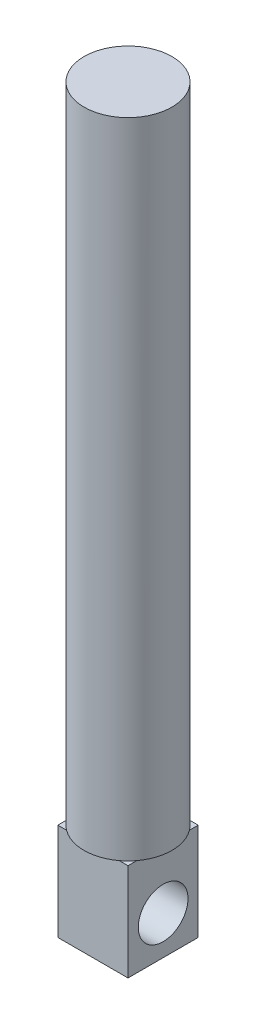
ISO-10303-21;
HEADER;
FILE_DESCRIPTION(('STEP AP214'),'2;1');
FILE_NAME('part.step','',(''),(''),'','','');
FILE_SCHEMA(('AUTOMOTIVE_DESIGN { 1 0 10303 214 1 1 1 1 }'));
ENDSEC;
DATA;
#1=APPLICATION_CONTEXT('core data for automotive mechanical design processes');
#2=APPLICATION_PROTOCOL_DEFINITION('international standard','automotive_design',2000,#1);
#3=PRODUCT_CONTEXT('',#1,'mechanical');
#4=PRODUCT('Part','Part','',(#3));
#5=PRODUCT_RELATED_PRODUCT_CATEGORY('part','',(#4));
#6=PRODUCT_DEFINITION_FORMATION('','',#4);
#7=PRODUCT_DEFINITION_CONTEXT('part definition',#1,'design');
#8=PRODUCT_DEFINITION('design','',#6,#7);
#9=PRODUCT_DEFINITION_SHAPE('','',#8);
#10=(LENGTH_UNIT() NAMED_UNIT(*) SI_UNIT(.MILLI.,.METRE.));
#11=(NAMED_UNIT(*) PLANE_ANGLE_UNIT() SI_UNIT($,.RADIAN.));
#12=(NAMED_UNIT(*) SI_UNIT($,.STERADIAN.) SOLID_ANGLE_UNIT());
#13=UNCERTAINTY_MEASURE_WITH_UNIT(LENGTH_MEASURE(1.E-05),#10,'distance_accuracy_value','');
#14=(GEOMETRIC_REPRESENTATION_CONTEXT(3) GLOBAL_UNCERTAINTY_ASSIGNED_CONTEXT((#13)) GLOBAL_UNIT_ASSIGNED_CONTEXT((#10,
#11,#12)) REPRESENTATION_CONTEXT('',''));
#15=CARTESIAN_POINT('',(0.,0.,0.));
#16=DIRECTION('',(0.,0.,1.));
#17=DIRECTION('',(1.,0.,0.));
#18=AXIS2_PLACEMENT_3D('',#15,#16,#17);
#19=CARTESIAN_POINT('',(0.,8.31,0.));
#20=DIRECTION('',(0.,-1.,0.));
#21=DIRECTION('',(0.,0.,-1.));
#22=AXIS2_PLACEMENT_3D('',#19,#20,#21);
#23=PLANE('',#22);
#24=CARTESIAN_POINT('',(3.,8.31,-3.));
#25=DIRECTION('',(0.,1.,0.));
#26=DIRECTION('',(0.,0.,1.));
#27=AXIS2_PLACEMENT_3D('',#24,#25,#26);
#28=CIRCLE('',#27,3.75);
#29=CARTESIAN_POINT('',(5.25,8.31,0.));
#30=VERTEX_POINT('',#29);
#31=CARTESIAN_POINT('',(6.,8.31,-0.749999999999999));
#32=VERTEX_POINT('',#31);
#33=EDGE_CURVE('E127',#30,#32,#28,.T.);
#34=ORIENTED_EDGE('',*,*,#33,.F.);
#35=DIRECTION('',(1.,0.,0.));
#36=VECTOR('',#35,1.);
#37=CARTESIAN_POINT('',(0.,8.31,0.));
#38=LINE('',#37,#36);
#39=CARTESIAN_POINT('',(6.,8.31,0.));
#40=VERTEX_POINT('',#39);
#41=EDGE_CURVE('E114',#30,#40,#38,.T.);
#42=ORIENTED_EDGE('',*,*,#41,.T.);
#43=DIRECTION('',(0.,0.,-1.));
#44=VECTOR('',#43,1.);
#45=CARTESIAN_POINT('',(6.,8.31,0.));
#46=LINE('',#45,#44);
#47=EDGE_CURVE('E148',#40,#32,#46,.T.);
#48=ORIENTED_EDGE('',*,*,#47,.T.);
#49=EDGE_LOOP('',(#34,#42,#48));
#50=FACE_BOUND('',#49,.T.);
#51=ADVANCED_FACE('F33',(#50),#23,.F.);
#52=CARTESIAN_POINT('',(6.,8.31,-5.25));
#53=VERTEX_POINT('',#52);
#54=CARTESIAN_POINT('',(5.25,8.31,-6.));
#55=VERTEX_POINT('',#54);
#56=EDGE_CURVE('E11',#53,#55,#28,.T.);
#57=ORIENTED_EDGE('',*,*,#56,.F.);
#58=CARTESIAN_POINT('',(6.,8.31,-6.));
#59=VERTEX_POINT('',#58);
#60=EDGE_CURVE('E111',#53,#59,#46,.T.);
#61=ORIENTED_EDGE('',*,*,#60,.T.);
#62=DIRECTION('',(-1.,0.,0.));
#63=VECTOR('',#62,1.);
#64=CARTESIAN_POINT('',(0.,8.31,-6.));
#65=LINE('',#64,#63);
#66=EDGE_CURVE('E144',#59,#55,#65,.T.);
#67=ORIENTED_EDGE('',*,*,#66,.T.);
#68=EDGE_LOOP('',(#57,#61,#67));
#69=FACE_BOUND('',#68,.T.);
#70=ADVANCED_FACE('F200',(#69),#23,.F.);
#71=CARTESIAN_POINT('',(0.749999999999999,8.31,-6.));
#72=VERTEX_POINT('',#71);
#73=CARTESIAN_POINT('',(0.,8.31,-5.25));
#74=VERTEX_POINT('',#73);
#75=EDGE_CURVE('E42',#72,#74,#28,.T.);
#76=ORIENTED_EDGE('',*,*,#75,.F.);
#77=CARTESIAN_POINT('',(0.,8.31,-6.));
#78=VERTEX_POINT('',#77);
#79=EDGE_CURVE('E145',#72,#78,#65,.T.);
#80=ORIENTED_EDGE('',*,*,#79,.T.);
#81=DIRECTION('',(0.,0.,1.));
#82=VECTOR('',#81,1.);
#83=CARTESIAN_POINT('',(0.,8.31,0.));
#84=LINE('',#83,#82);
#85=EDGE_CURVE('E180',#78,#74,#84,.T.);
#86=ORIENTED_EDGE('',*,*,#85,.T.);
#87=EDGE_LOOP('',(#76,#80,#86));
#88=FACE_BOUND('',#87,.T.);
#89=ADVANCED_FACE('F206',(#88),#23,.F.);
#90=CARTESIAN_POINT('',(0.,8.31,0.));
#91=DIRECTION('',(1.,0.,0.));
#92=DIRECTION('',(0.,0.,-1.));
#93=AXIS2_PLACEMENT_3D('',#90,#91,#92);
#94=PLANE('',#93);
#95=CARTESIAN_POINT('',(0.,3.31,-3.));
#96=DIRECTION('',(1.,0.,0.));
#97=DIRECTION('',(0.,0.,-1.));
#98=AXIS2_PLACEMENT_3D('',#95,#96,#97);
#99=CIRCLE('',#98,2.125);
#100=CARTESIAN_POINT('',(0.,3.31,-5.125));
#101=VERTEX_POINT('',#100);
#102=EDGE_CURVE('E155',#101,#101,#99,.T.);
#103=ORIENTED_EDGE('',*,*,#102,.T.);
#104=EDGE_LOOP('',(#103));
#105=FACE_BOUND('',#104,.T.);
#106=DIRECTION('',(0.,0.,1.));
#107=VECTOR('',#106,1.);
#108=CARTESIAN_POINT('',(0.,0.,0.));
#109=LINE('',#108,#107);
#110=CARTESIAN_POINT('',(0.,0.,-6.));
#111=VERTEX_POINT('',#110);
#112=CARTESIAN_POINT('',(0.,0.,0.));
#113=VERTEX_POINT('',#112);
#114=EDGE_CURVE('E151',#111,#113,#109,.T.);
#115=ORIENTED_EDGE('',*,*,#114,.T.);
#116=DIRECTION('',(0.,-1.,0.));
#117=VECTOR('',#116,1.);
#118=CARTESIAN_POINT('',(0.,8.31,0.));
#119=LINE('',#118,#117);
#120=CARTESIAN_POINT('',(0.,8.31,0.));
#121=VERTEX_POINT('',#120);
#122=EDGE_CURVE('E37',#121,#113,#119,.T.);
#123=ORIENTED_EDGE('',*,*,#122,.F.);
#124=CARTESIAN_POINT('',(0.,8.31,-0.749999999999999));
#125=VERTEX_POINT('',#124);
#126=EDGE_CURVE('E107',#125,#121,#84,.T.);
#127=ORIENTED_EDGE('',*,*,#126,.F.);
#128=EDGE_CURVE('E182',#74,#125,#84,.T.);
#129=ORIENTED_EDGE('',*,*,#128,.F.);
#130=ORIENTED_EDGE('',*,*,#85,.F.);
#131=DIRECTION('',(0.,-1.,0.));
#132=VECTOR('',#131,1.);
#133=CARTESIAN_POINT('',(0.,8.31,-6.));
#134=LINE('',#133,#132);
#135=EDGE_CURVE('E147',#78,#111,#134,.T.);
#136=ORIENTED_EDGE('',*,*,#135,.T.);
#137=EDGE_LOOP('',(#115,#123,#127,#129,#130,#136));
#138=FACE_BOUND('',#137,.T.);
#139=ADVANCED_FACE('F35',(#105,#138),#94,.F.);
#140=CARTESIAN_POINT('',(0.,8.31,0.));
#141=DIRECTION('',(0.,0.,-1.));
#142=DIRECTION('',(-1.,0.,0.));
#143=AXIS2_PLACEMENT_3D('',#140,#141,#142);
#144=PLANE('',#143);
#145=DIRECTION('',(1.,0.,0.));
#146=VECTOR('',#145,1.);
#147=CARTESIAN_POINT('',(0.,0.,0.));
#148=LINE('',#147,#146);
#149=CARTESIAN_POINT('',(6.,0.,0.));
#150=VERTEX_POINT('',#149);
#151=EDGE_CURVE('E154',#113,#150,#148,.T.);
#152=ORIENTED_EDGE('',*,*,#151,.T.);
#153=DIRECTION('',(0.,-1.,0.));
#154=VECTOR('',#153,1.);
#155=CARTESIAN_POINT('',(6.,8.31,0.));
#156=LINE('',#155,#154);
#157=EDGE_CURVE('E131',#40,#150,#156,.T.);
#158=ORIENTED_EDGE('',*,*,#157,.F.);
#159=ORIENTED_EDGE('',*,*,#41,.F.);
#160=CARTESIAN_POINT('',(0.749999999999999,8.31,0.));
#161=VERTEX_POINT('',#160);
#162=EDGE_CURVE('E112',#161,#30,#38,.T.);
#163=ORIENTED_EDGE('',*,*,#162,.F.);
#164=EDGE_CURVE('E101',#121,#161,#38,.T.);
#165=ORIENTED_EDGE('',*,*,#164,.F.);
#166=ORIENTED_EDGE('',*,*,#122,.T.);
#167=EDGE_LOOP('',(#152,#158,#159,#163,#165,#166));
#168=FACE_BOUND('',#167,.T.);
#169=ADVANCED_FACE('F118',(#168),#144,.F.);
#170=CARTESIAN_POINT('',(6.,8.31,0.));
#171=DIRECTION('',(-1.,0.,0.));
#172=DIRECTION('',(0.,0.,1.));
#173=AXIS2_PLACEMENT_3D('',#170,#171,#172);
#174=PLANE('',#173);
#175=CARTESIAN_POINT('',(6.,3.31,-3.));
#176=DIRECTION('',(1.,0.,0.));
#177=DIRECTION('',(0.,0.,-1.));
#178=AXIS2_PLACEMENT_3D('',#175,#176,#177);
#179=CIRCLE('',#178,2.125);
#180=CARTESIAN_POINT('',(6.,3.31,-5.125));
#181=VERTEX_POINT('',#180);
#182=EDGE_CURVE('E137',#181,#181,#179,.T.);
#183=ORIENTED_EDGE('',*,*,#182,.F.);
#184=EDGE_LOOP('',(#183));
#185=FACE_BOUND('',#184,.T.);
#186=DIRECTION('',(0.,0.,-1.));
#187=VECTOR('',#186,1.);
#188=CARTESIAN_POINT('',(6.,0.,0.));
#189=LINE('',#188,#187);
#190=CARTESIAN_POINT('',(6.,0.,-6.));
#191=VERTEX_POINT('',#190);
#192=EDGE_CURVE('E157',#150,#191,#189,.T.);
#193=ORIENTED_EDGE('',*,*,#192,.T.);
#194=DIRECTION('',(0.,-1.,0.));
#195=VECTOR('',#194,1.);
#196=CARTESIAN_POINT('',(6.,8.31,-6.));
#197=LINE('',#196,#195);
#198=EDGE_CURVE('E163',#59,#191,#197,.T.);
#199=ORIENTED_EDGE('',*,*,#198,.F.);
#200=ORIENTED_EDGE('',*,*,#60,.F.);
#201=EDGE_CURVE('E327',#32,#53,#46,.T.);
#202=ORIENTED_EDGE('',*,*,#201,.F.);
#203=ORIENTED_EDGE('',*,*,#47,.F.);
#204=ORIENTED_EDGE('',*,*,#157,.T.);
#205=EDGE_LOOP('',(#193,#199,#200,#202,#203,#204));
#206=FACE_BOUND('',#205,.T.);
#207=ADVANCED_FACE('F169',(#185,#206),#174,.F.);
#208=CARTESIAN_POINT('',(0.,8.31,-6.));
#209=DIRECTION('',(0.,0.,1.));
#210=DIRECTION('',(1.,0.,0.));
#211=AXIS2_PLACEMENT_3D('',#208,#209,#210);
#212=PLANE('',#211);
#213=DIRECTION('',(-1.,0.,0.));
#214=VECTOR('',#213,1.);
#215=CARTESIAN_POINT('',(0.,0.,-6.));
#216=LINE('',#215,#214);
#217=EDGE_CURVE('E159',#191,#111,#216,.T.);
#218=ORIENTED_EDGE('',*,*,#217,.T.);
#219=ORIENTED_EDGE('',*,*,#135,.F.);
#220=ORIENTED_EDGE('',*,*,#79,.F.);
#221=EDGE_CURVE('E57',#55,#72,#65,.T.);
#222=ORIENTED_EDGE('',*,*,#221,.F.);
#223=ORIENTED_EDGE('',*,*,#66,.F.);
#224=ORIENTED_EDGE('',*,*,#198,.T.);
#225=EDGE_LOOP('',(#218,#219,#220,#222,#223,#224));
#226=FACE_BOUND('',#225,.T.);
#227=ADVANCED_FACE('F177',(#226),#212,.F.);
#228=EDGE_CURVE('E105',#125,#161,#28,.T.);
#229=ORIENTED_EDGE('',*,*,#228,.F.);
#230=ORIENTED_EDGE('',*,*,#126,.T.);
#231=ORIENTED_EDGE('',*,*,#164,.T.);
#232=EDGE_LOOP('',(#229,#230,#231));
#233=FACE_BOUND('',#232,.T.);
#234=ADVANCED_FACE('F103',(#233),#23,.F.);
#235=CARTESIAN_POINT('',(0.,0.,0.));
#236=DIRECTION('',(0.,-1.,0.));
#237=DIRECTION('',(0.,0.,-1.));
#238=AXIS2_PLACEMENT_3D('',#235,#236,#237);
#239=PLANE('',#238);
#240=ORIENTED_EDGE('',*,*,#114,.F.);
#241=ORIENTED_EDGE('',*,*,#217,.F.);
#242=ORIENTED_EDGE('',*,*,#192,.F.);
#243=ORIENTED_EDGE('',*,*,#151,.F.);
#244=EDGE_LOOP('',(#240,#241,#242,#243));
#245=FACE_BOUND('',#244,.T.);
#246=ADVANCED_FACE('F175',(#245),#239,.T.);
#247=CARTESIAN_POINT('',(-4.,3.31,-3.));
#248=DIRECTION('',(1.,0.,0.));
#249=DIRECTION('',(0.,0.,-1.));
#250=AXIS2_PLACEMENT_3D('',#247,#248,#249);
#251=CYLINDRICAL_SURFACE('',#250,2.125);
#252=ORIENTED_EDGE('',*,*,#182,.T.);
#253=EDGE_LOOP('',(#252));
#254=FACE_BOUND('',#253,.T.);
#255=ORIENTED_EDGE('',*,*,#102,.F.);
#256=EDGE_LOOP('',(#255));
#257=FACE_BOUND('',#256,.T.);
#258=ADVANCED_FACE('F189',(#254,#257),#251,.F.);
#259=CARTESIAN_POINT('',(3.,8.31,-3.));
#260=DIRECTION('',(0.,1.,0.));
#261=DIRECTION('',(0.,0.,1.));
#262=AXIS2_PLACEMENT_3D('',#259,#260,#261);
#263=PLANE('',#262);
#264=EDGE_CURVE('E126',#74,#125,#28,.T.);
#265=ORIENTED_EDGE('',*,*,#264,.F.);
#266=ORIENTED_EDGE('',*,*,#128,.T.);
#267=EDGE_LOOP('',(#265,#266));
#268=FACE_BOUND('',#267,.T.);
#269=ADVANCED_FACE('F223',(#268),#263,.F.);
#270=EDGE_CURVE('E122',#161,#30,#28,.T.);
#271=ORIENTED_EDGE('',*,*,#270,.F.);
#272=ORIENTED_EDGE('',*,*,#162,.T.);
#273=EDGE_LOOP('',(#271,#272));
#274=FACE_BOUND('',#273,.T.);
#275=ADVANCED_FACE('F123',(#274),#263,.F.);
#276=EDGE_CURVE('E44',#32,#53,#28,.T.);
#277=ORIENTED_EDGE('',*,*,#276,.F.);
#278=ORIENTED_EDGE('',*,*,#201,.T.);
#279=EDGE_LOOP('',(#277,#278));
#280=FACE_BOUND('',#279,.T.);
#281=ADVANCED_FACE('F249',(#280),#263,.F.);
#282=EDGE_CURVE('E138',#55,#72,#28,.T.);
#283=ORIENTED_EDGE('',*,*,#282,.F.);
#284=ORIENTED_EDGE('',*,*,#221,.T.);
#285=EDGE_LOOP('',(#283,#284));
#286=FACE_BOUND('',#285,.T.);
#287=ADVANCED_FACE('F143',(#286),#263,.F.);
#288=CARTESIAN_POINT('',(3.,63.31,-3.));
#289=DIRECTION('',(0.,-1.,0.));
#290=DIRECTION('',(0.,0.,-1.));
#291=AXIS2_PLACEMENT_3D('',#288,#289,#290);
#292=CYLINDRICAL_SURFACE('',#291,3.75);
#293=CARTESIAN_POINT('',(3.,63.31,-3.));
#294=DIRECTION('',(0.,1.,0.));
#295=DIRECTION('',(0.,0.,1.));
#296=AXIS2_PLACEMENT_3D('',#293,#294,#295);
#297=CIRCLE('',#296,3.75);
#298=CARTESIAN_POINT('',(3.,63.31,0.75));
#299=VERTEX_POINT('',#298);
#300=EDGE_CURVE('E134',#299,#299,#297,.T.);
#301=ORIENTED_EDGE('',*,*,#300,.F.);
#302=EDGE_LOOP('',(#301));
#303=FACE_BOUND('',#302,.T.);
#304=ORIENTED_EDGE('',*,*,#33,.T.);
#305=ORIENTED_EDGE('',*,*,#276,.T.);
#306=ORIENTED_EDGE('',*,*,#56,.T.);
#307=ORIENTED_EDGE('',*,*,#282,.T.);
#308=ORIENTED_EDGE('',*,*,#75,.T.);
#309=ORIENTED_EDGE('',*,*,#264,.T.);
#310=ORIENTED_EDGE('',*,*,#228,.T.);
#311=ORIENTED_EDGE('',*,*,#270,.T.);
#312=EDGE_LOOP('',(#304,#305,#306,#307,#308,#309,#310,#311));
#313=FACE_BOUND('',#312,.T.);
#314=ADVANCED_FACE('F129',(#303,#313),#292,.T.);
#315=CARTESIAN_POINT('',(3.,63.31,-3.));
#316=DIRECTION('',(0.,1.,0.));
#317=DIRECTION('',(0.,0.,1.));
#318=AXIS2_PLACEMENT_3D('',#315,#316,#317);
#319=PLANE('',#318);
#320=ORIENTED_EDGE('',*,*,#300,.T.);
#321=EDGE_LOOP('',(#320));
#322=FACE_BOUND('',#321,.T.);
#323=ADVANCED_FACE('F231',(#322),#319,.T.);
#324=CLOSED_SHELL('',(#51,#70,#89,#139,#169,#207,#227,#234,#246,#258,#269,#275,#281,#287,#314,#323));
#325=MANIFOLD_SOLID_BREP('B2',#324);
#326=ADVANCED_BREP_SHAPE_REPRESENTATION('',(#18,#325),#14);
#327=SHAPE_DEFINITION_REPRESENTATION(#9,#326);
ENDSEC;
END-ISO-10303-21;
